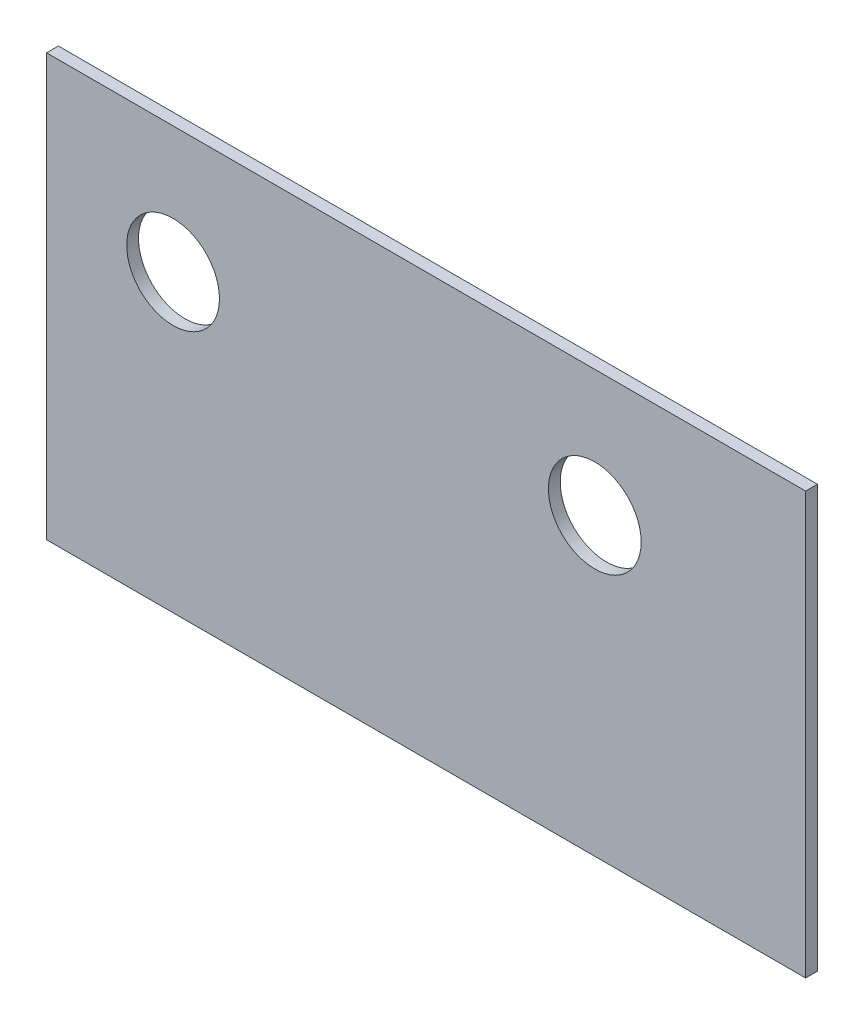
ISO-10303-21;
HEADER;
FILE_DESCRIPTION(('STEP AP214'),'2;1');
FILE_NAME('part.step','',(''),(''),'','','');
FILE_SCHEMA(('AUTOMOTIVE_DESIGN { 1 0 10303 214 1 1 1 1 }'));
ENDSEC;
DATA;
#1=APPLICATION_CONTEXT('core data for automotive mechanical design processes');
#2=APPLICATION_PROTOCOL_DEFINITION('international standard','automotive_design',2000,#1);
#3=PRODUCT_CONTEXT('',#1,'mechanical');
#4=PRODUCT('Part','Part','',(#3));
#5=PRODUCT_RELATED_PRODUCT_CATEGORY('part','',(#4));
#6=PRODUCT_DEFINITION_FORMATION('','',#4);
#7=PRODUCT_DEFINITION_CONTEXT('part definition',#1,'design');
#8=PRODUCT_DEFINITION('design','',#6,#7);
#9=PRODUCT_DEFINITION_SHAPE('','',#8);
#10=(LENGTH_UNIT() NAMED_UNIT(*) SI_UNIT(.MILLI.,.METRE.));
#11=(NAMED_UNIT(*) PLANE_ANGLE_UNIT() SI_UNIT($,.RADIAN.));
#12=(NAMED_UNIT(*) SI_UNIT($,.STERADIAN.) SOLID_ANGLE_UNIT());
#13=UNCERTAINTY_MEASURE_WITH_UNIT(LENGTH_MEASURE(1.E-05),#10,'distance_accuracy_value','');
#14=(GEOMETRIC_REPRESENTATION_CONTEXT(3) GLOBAL_UNCERTAINTY_ASSIGNED_CONTEXT((#13)) GLOBAL_UNIT_ASSIGNED_CONTEXT((#10,
#11,#12)) REPRESENTATION_CONTEXT('',''));
#15=CARTESIAN_POINT('',(0.,0.,0.));
#16=DIRECTION('',(0.,0.,1.));
#17=DIRECTION('',(1.,0.,0.));
#18=AXIS2_PLACEMENT_3D('',#15,#16,#17);
#19=CARTESIAN_POINT('',(0.,0.,2.8));
#20=DIRECTION('',(0.,0.,-1.));
#21=DIRECTION('',(-1.,0.,0.));
#22=AXIS2_PLACEMENT_3D('',#19,#20,#21);
#23=PLANE('',#22);
#24=DIRECTION('',(0.,1.,0.));
#25=VECTOR('',#24,1.);
#26=CARTESIAN_POINT('',(180.,100.,2.8));
#27=LINE('',#26,#25);
#28=CARTESIAN_POINT('',(180.,0.,2.8));
#29=VERTEX_POINT('',#28);
#30=CARTESIAN_POINT('',(180.,100.,2.8));
#31=VERTEX_POINT('',#30);
#32=EDGE_CURVE('E86',#29,#31,#27,.T.);
#33=ORIENTED_EDGE('',*,*,#32,.T.);
#34=DIRECTION('',(-1.,0.,0.));
#35=VECTOR('',#34,1.);
#36=CARTESIAN_POINT('',(180.,100.,2.8));
#37=LINE('',#36,#35);
#38=CARTESIAN_POINT('',(0.,100.,2.8));
#39=VERTEX_POINT('',#38);
#40=EDGE_CURVE('E81',#31,#39,#37,.T.);
#41=ORIENTED_EDGE('',*,*,#40,.T.);
#42=DIRECTION('',(0.,-1.,0.));
#43=VECTOR('',#42,1.);
#44=CARTESIAN_POINT('',(0.,100.,2.8));
#45=LINE('',#44,#43);
#46=CARTESIAN_POINT('',(0.,0.,2.8));
#47=VERTEX_POINT('',#46);
#48=EDGE_CURVE('E84',#39,#47,#45,.T.);
#49=ORIENTED_EDGE('',*,*,#48,.T.);
#50=DIRECTION('',(1.,0.,0.));
#51=VECTOR('',#50,1.);
#52=CARTESIAN_POINT('',(180.,0.,2.8));
#53=LINE('',#52,#51);
#54=EDGE_CURVE('E51',#47,#29,#53,.T.);
#55=ORIENTED_EDGE('',*,*,#54,.T.);
#56=EDGE_LOOP('',(#33,#41,#49,#55));
#57=FACE_BOUND('',#56,.T.);
#58=CARTESIAN_POINT('',(30.,70.,2.8));
#59=DIRECTION('',(0.,0.,1.));
#60=DIRECTION('',(1.,0.,0.));
#61=AXIS2_PLACEMENT_3D('',#58,#59,#60);
#62=CIRCLE('',#61,11.);
#63=CARTESIAN_POINT('',(41.,70.,2.8));
#64=VERTEX_POINT('',#63);
#65=EDGE_CURVE('E101',#64,#64,#62,.T.);
#66=ORIENTED_EDGE('',*,*,#65,.F.);
#67=EDGE_LOOP('',(#66));
#68=FACE_BOUND('',#67,.T.);
#69=CARTESIAN_POINT('',(130.,70.,2.8));
#70=DIRECTION('',(0.,0.,1.));
#71=DIRECTION('',(1.,0.,0.));
#72=AXIS2_PLACEMENT_3D('',#69,#70,#71);
#73=CIRCLE('',#72,11.);
#74=CARTESIAN_POINT('',(141.,70.,2.8));
#75=VERTEX_POINT('',#74);
#76=EDGE_CURVE('E116',#75,#75,#73,.T.);
#77=ORIENTED_EDGE('',*,*,#76,.F.);
#78=EDGE_LOOP('',(#77));
#79=FACE_BOUND('',#78,.T.);
#80=ADVANCED_FACE('F34',(#57,#68,#79),#23,.F.);
#81=CARTESIAN_POINT('',(0.,0.,0.));
#82=DIRECTION('',(0.,0.,-1.));
#83=DIRECTION('',(-1.,0.,0.));
#84=AXIS2_PLACEMENT_3D('',#81,#82,#83);
#85=PLANE('',#84);
#86=CARTESIAN_POINT('',(30.,70.,0.));
#87=DIRECTION('',(0.,0.,1.));
#88=DIRECTION('',(1.,0.,0.));
#89=AXIS2_PLACEMENT_3D('',#86,#87,#88);
#90=CIRCLE('',#89,11.);
#91=CARTESIAN_POINT('',(41.,70.,0.));
#92=VERTEX_POINT('',#91);
#93=EDGE_CURVE('E113',#92,#92,#90,.T.);
#94=ORIENTED_EDGE('',*,*,#93,.T.);
#95=EDGE_LOOP('',(#94));
#96=FACE_BOUND('',#95,.T.);
#97=DIRECTION('',(0.,1.,0.));
#98=VECTOR('',#97,1.);
#99=CARTESIAN_POINT('',(180.,100.,0.));
#100=LINE('',#99,#98);
#101=CARTESIAN_POINT('',(180.,0.,0.));
#102=VERTEX_POINT('',#101);
#103=CARTESIAN_POINT('',(180.,100.,0.));
#104=VERTEX_POINT('',#103);
#105=EDGE_CURVE('E98',#102,#104,#100,.T.);
#106=ORIENTED_EDGE('',*,*,#105,.F.);
#107=DIRECTION('',(1.,0.,0.));
#108=VECTOR('',#107,1.);
#109=CARTESIAN_POINT('',(180.,0.,0.));
#110=LINE('',#109,#108);
#111=CARTESIAN_POINT('',(0.,0.,0.));
#112=VERTEX_POINT('',#111);
#113=EDGE_CURVE('E74',#112,#102,#110,.T.);
#114=ORIENTED_EDGE('',*,*,#113,.F.);
#115=DIRECTION('',(0.,-1.,0.));
#116=VECTOR('',#115,1.);
#117=CARTESIAN_POINT('',(0.,100.,0.));
#118=LINE('',#117,#116);
#119=CARTESIAN_POINT('',(0.,100.,0.));
#120=VERTEX_POINT('',#119);
#121=EDGE_CURVE('E68',#120,#112,#118,.T.);
#122=ORIENTED_EDGE('',*,*,#121,.F.);
#123=DIRECTION('',(-1.,0.,0.));
#124=VECTOR('',#123,1.);
#125=CARTESIAN_POINT('',(180.,100.,0.));
#126=LINE('',#125,#124);
#127=EDGE_CURVE('E90',#104,#120,#126,.T.);
#128=ORIENTED_EDGE('',*,*,#127,.F.);
#129=EDGE_LOOP('',(#106,#114,#122,#128));
#130=FACE_BOUND('',#129,.T.);
#131=CARTESIAN_POINT('',(130.,70.,0.));
#132=DIRECTION('',(0.,0.,1.));
#133=DIRECTION('',(1.,0.,0.));
#134=AXIS2_PLACEMENT_3D('',#131,#132,#133);
#135=CIRCLE('',#134,11.);
#136=CARTESIAN_POINT('',(141.,70.,0.));
#137=VERTEX_POINT('',#136);
#138=EDGE_CURVE('E119',#137,#137,#135,.T.);
#139=ORIENTED_EDGE('',*,*,#138,.T.);
#140=EDGE_LOOP('',(#139));
#141=FACE_BOUND('',#140,.T.);
#142=ADVANCED_FACE('F109',(#96,#130,#141),#85,.T.);
#143=CARTESIAN_POINT('',(180.,100.,2.8));
#144=DIRECTION('',(-1.,0.,0.));
#145=DIRECTION('',(0.,0.,1.));
#146=AXIS2_PLACEMENT_3D('',#143,#144,#145);
#147=PLANE('',#146);
#148=ORIENTED_EDGE('',*,*,#105,.T.);
#149=DIRECTION('',(0.,0.,-1.));
#150=VECTOR('',#149,1.);
#151=CARTESIAN_POINT('',(180.,100.,2.8));
#152=LINE('',#151,#150);
#153=EDGE_CURVE('E11',#31,#104,#152,.T.);
#154=ORIENTED_EDGE('',*,*,#153,.F.);
#155=ORIENTED_EDGE('',*,*,#32,.F.);
#156=DIRECTION('',(0.,0.,-1.));
#157=VECTOR('',#156,1.);
#158=CARTESIAN_POINT('',(180.,0.,2.8));
#159=LINE('',#158,#157);
#160=EDGE_CURVE('E94',#29,#102,#159,.T.);
#161=ORIENTED_EDGE('',*,*,#160,.T.);
#162=EDGE_LOOP('',(#148,#154,#155,#161));
#163=FACE_BOUND('',#162,.T.);
#164=ADVANCED_FACE('F36',(#163),#147,.F.);
#165=CARTESIAN_POINT('',(180.,100.,2.8));
#166=DIRECTION('',(0.,-1.,0.));
#167=DIRECTION('',(1.,0.,0.));
#168=AXIS2_PLACEMENT_3D('',#165,#166,#167);
#169=PLANE('',#168);
#170=ORIENTED_EDGE('',*,*,#127,.T.);
#171=DIRECTION('',(0.,0.,-1.));
#172=VECTOR('',#171,1.);
#173=CARTESIAN_POINT('',(0.,100.,2.8));
#174=LINE('',#173,#172);
#175=EDGE_CURVE('E43',#39,#120,#174,.T.);
#176=ORIENTED_EDGE('',*,*,#175,.F.);
#177=ORIENTED_EDGE('',*,*,#40,.F.);
#178=ORIENTED_EDGE('',*,*,#153,.T.);
#179=EDGE_LOOP('',(#170,#176,#177,#178));
#180=FACE_BOUND('',#179,.T.);
#181=ADVANCED_FACE('F89',(#180),#169,.F.);
#182=CARTESIAN_POINT('',(0.,100.,2.8));
#183=DIRECTION('',(1.,0.,0.));
#184=DIRECTION('',(0.,1.,0.));
#185=AXIS2_PLACEMENT_3D('',#182,#183,#184);
#186=PLANE('',#185);
#187=ORIENTED_EDGE('',*,*,#121,.T.);
#188=DIRECTION('',(0.,0.,-1.));
#189=VECTOR('',#188,1.);
#190=CARTESIAN_POINT('',(0.,0.,2.8));
#191=LINE('',#190,#189);
#192=EDGE_CURVE('E91',#47,#112,#191,.T.);
#193=ORIENTED_EDGE('',*,*,#192,.F.);
#194=ORIENTED_EDGE('',*,*,#48,.F.);
#195=ORIENTED_EDGE('',*,*,#175,.T.);
#196=EDGE_LOOP('',(#187,#193,#194,#195));
#197=FACE_BOUND('',#196,.T.);
#198=ADVANCED_FACE('F92',(#197),#186,.F.);
#199=CARTESIAN_POINT('',(180.,0.,2.8));
#200=DIRECTION('',(0.,1.,0.));
#201=DIRECTION('',(-1.,0.,0.));
#202=AXIS2_PLACEMENT_3D('',#199,#200,#201);
#203=PLANE('',#202);
#204=ORIENTED_EDGE('',*,*,#113,.T.);
#205=ORIENTED_EDGE('',*,*,#160,.F.);
#206=ORIENTED_EDGE('',*,*,#54,.F.);
#207=ORIENTED_EDGE('',*,*,#192,.T.);
#208=EDGE_LOOP('',(#204,#205,#206,#207));
#209=FACE_BOUND('',#208,.T.);
#210=ADVANCED_FACE('F106',(#209),#203,.F.);
#211=CARTESIAN_POINT('',(30.,70.,2.8));
#212=DIRECTION('',(0.,0.,-1.));
#213=DIRECTION('',(-1.,0.,0.));
#214=AXIS2_PLACEMENT_3D('',#211,#212,#213);
#215=CYLINDRICAL_SURFACE('',#214,11.);
#216=ORIENTED_EDGE('',*,*,#65,.T.);
#217=EDGE_LOOP('',(#216));
#218=FACE_BOUND('',#217,.T.);
#219=ORIENTED_EDGE('',*,*,#93,.F.);
#220=EDGE_LOOP('',(#219));
#221=FACE_BOUND('',#220,.T.);
#222=ADVANCED_FACE('F136',(#218,#221),#215,.F.);
#223=CARTESIAN_POINT('',(130.,70.,2.8));
#224=DIRECTION('',(0.,0.,-1.));
#225=DIRECTION('',(-1.,0.,0.));
#226=AXIS2_PLACEMENT_3D('',#223,#224,#225);
#227=CYLINDRICAL_SURFACE('',#226,11.);
#228=ORIENTED_EDGE('',*,*,#76,.T.);
#229=EDGE_LOOP('',(#228));
#230=FACE_BOUND('',#229,.T.);
#231=ORIENTED_EDGE('',*,*,#138,.F.);
#232=EDGE_LOOP('',(#231));
#233=FACE_BOUND('',#232,.T.);
#234=ADVANCED_FACE('F125',(#230,#233),#227,.F.);
#235=CLOSED_SHELL('',(#80,#142,#164,#181,#198,#210,#222,#234));
#236=MANIFOLD_SOLID_BREP('B2',#235);
#237=ADVANCED_BREP_SHAPE_REPRESENTATION('',(#18,#236),#14);
#238=SHAPE_DEFINITION_REPRESENTATION(#9,#237);
ENDSEC;
END-ISO-10303-21;
